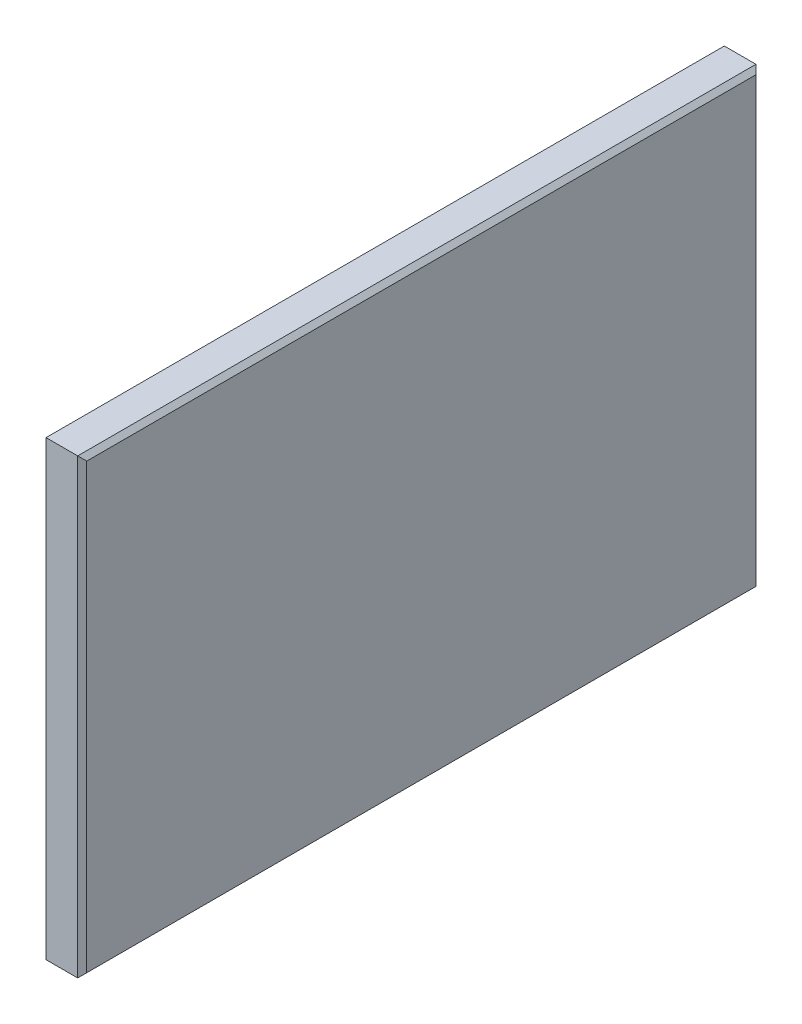
ISO-10303-21;
HEADER;
FILE_DESCRIPTION(('STEP AP214'),'2;1');
FILE_NAME('part.step','',(''),(''),'','','');
FILE_SCHEMA(('AUTOMOTIVE_DESIGN { 1 0 10303 214 1 1 1 1 }'));
ENDSEC;
DATA;
#1=APPLICATION_CONTEXT('core data for automotive mechanical design processes');
#2=APPLICATION_PROTOCOL_DEFINITION('international standard','automotive_design',2000,#1);
#3=PRODUCT_CONTEXT('',#1,'mechanical');
#4=PRODUCT('Part','Part','',(#3));
#5=PRODUCT_RELATED_PRODUCT_CATEGORY('part','',(#4));
#6=PRODUCT_DEFINITION_FORMATION('','',#4);
#7=PRODUCT_DEFINITION_CONTEXT('part definition',#1,'design');
#8=PRODUCT_DEFINITION('design','',#6,#7);
#9=PRODUCT_DEFINITION_SHAPE('','',#8);
#10=(LENGTH_UNIT() NAMED_UNIT(*) SI_UNIT(.MILLI.,.METRE.));
#11=(NAMED_UNIT(*) PLANE_ANGLE_UNIT() SI_UNIT($,.RADIAN.));
#12=(NAMED_UNIT(*) SI_UNIT($,.STERADIAN.) SOLID_ANGLE_UNIT());
#13=UNCERTAINTY_MEASURE_WITH_UNIT(LENGTH_MEASURE(1.E-05),#10,'distance_accuracy_value','');
#14=(GEOMETRIC_REPRESENTATION_CONTEXT(3) GLOBAL_UNCERTAINTY_ASSIGNED_CONTEXT((#13)) GLOBAL_UNIT_ASSIGNED_CONTEXT((#10,
#11,#12)) REPRESENTATION_CONTEXT('',''));
#15=CARTESIAN_POINT('',(0.,0.,0.));
#16=DIRECTION('',(0.,0.,1.));
#17=DIRECTION('',(1.,0.,0.));
#18=AXIS2_PLACEMENT_3D('',#15,#16,#17);
#19=CARTESIAN_POINT('',(4.572,25.4,38.1));
#20=DIRECTION('',(0.,0.,-1.));
#21=DIRECTION('',(-1.,0.,0.));
#22=AXIS2_PLACEMENT_3D('',#19,#20,#21);
#23=PLANE('',#22);
#24=DIRECTION('',(-1.,0.,0.));
#25=VECTOR('',#24,1.);
#26=CARTESIAN_POINT('',(4.572,25.4,38.1));
#27=LINE('',#26,#25);
#28=CARTESIAN_POINT('',(4.06399999999999,25.4,38.1));
#29=VERTEX_POINT('',#28);
#30=CARTESIAN_POINT('',(0.508000000000008,25.4,38.1));
#31=VERTEX_POINT('',#30);
#32=EDGE_CURVE('E142',#29,#31,#27,.T.);
#33=ORIENTED_EDGE('',*,*,#32,.T.);
#34=DIRECTION('',(0.,-1.,0.));
#35=VECTOR('',#34,1.);
#36=CARTESIAN_POINT('',(0.508000000000008,25.4,38.1));
#37=LINE('',#36,#35);
#38=CARTESIAN_POINT('',(0.508000000000008,-25.4,38.1));
#39=VERTEX_POINT('',#38);
#40=EDGE_CURVE('E151',#31,#39,#37,.T.);
#41=ORIENTED_EDGE('',*,*,#40,.T.);
#42=DIRECTION('',(-1.,0.,0.));
#43=VECTOR('',#42,1.);
#44=CARTESIAN_POINT('',(4.572,-25.4,38.1));
#45=LINE('',#44,#43);
#46=CARTESIAN_POINT('',(4.06399999999999,-25.4,38.1));
#47=VERTEX_POINT('',#46);
#48=EDGE_CURVE('E120',#47,#39,#45,.T.);
#49=ORIENTED_EDGE('',*,*,#48,.F.);
#50=DIRECTION('',(0.,1.,0.));
#51=VECTOR('',#50,1.);
#52=CARTESIAN_POINT('',(4.06399999999999,25.4,38.1));
#53=LINE('',#52,#51);
#54=EDGE_CURVE('E153',#47,#29,#53,.T.);
#55=ORIENTED_EDGE('',*,*,#54,.T.);
#56=EDGE_LOOP('',(#33,#41,#49,#55));
#57=FACE_BOUND('',#56,.T.);
#58=ADVANCED_FACE('F33',(#57),#23,.F.);
#59=CARTESIAN_POINT('',(4.572,-25.4,38.1));
#60=DIRECTION('',(0.,1.,0.));
#61=DIRECTION('',(0.,0.,1.));
#62=AXIS2_PLACEMENT_3D('',#59,#60,#61);
#63=PLANE('',#62);
#64=ORIENTED_EDGE('',*,*,#48,.T.);
#65=DIRECTION('',(0.,0.,-1.));
#66=VECTOR('',#65,1.);
#67=CARTESIAN_POINT('',(0.508000000000008,-25.4,38.1));
#68=LINE('',#67,#66);
#69=CARTESIAN_POINT('',(0.508000000000008,-25.4,-38.1));
#70=VERTEX_POINT('',#69);
#71=EDGE_CURVE('E119',#39,#70,#68,.T.);
#72=ORIENTED_EDGE('',*,*,#71,.T.);
#73=DIRECTION('',(-1.,0.,0.));
#74=VECTOR('',#73,1.);
#75=CARTESIAN_POINT('',(4.572,-25.4,-38.1));
#76=LINE('',#75,#74);
#77=CARTESIAN_POINT('',(4.06399999999999,-25.4,-38.1));
#78=VERTEX_POINT('',#77);
#79=EDGE_CURVE('E102',#78,#70,#76,.T.);
#80=ORIENTED_EDGE('',*,*,#79,.F.);
#81=DIRECTION('',(0.,0.,1.));
#82=VECTOR('',#81,1.);
#83=CARTESIAN_POINT('',(4.06399999999999,-25.4,38.1));
#84=LINE('',#83,#82);
#85=EDGE_CURVE('E116',#78,#47,#84,.T.);
#86=ORIENTED_EDGE('',*,*,#85,.T.);
#87=EDGE_LOOP('',(#64,#72,#80,#86));
#88=FACE_BOUND('',#87,.T.);
#89=ADVANCED_FACE('F115',(#88),#63,.F.);
#90=CARTESIAN_POINT('',(4.572,25.4,-38.1));
#91=DIRECTION('',(0.,0.,1.));
#92=DIRECTION('',(0.,-1.,0.));
#93=AXIS2_PLACEMENT_3D('',#90,#91,#92);
#94=PLANE('',#93);
#95=ORIENTED_EDGE('',*,*,#79,.T.);
#96=DIRECTION('',(0.,1.,0.));
#97=VECTOR('',#96,1.);
#98=CARTESIAN_POINT('',(0.508000000000008,25.4,-38.1));
#99=LINE('',#98,#97);
#100=CARTESIAN_POINT('',(0.508000000000008,25.4,-38.1));
#101=VERTEX_POINT('',#100);
#102=EDGE_CURVE('E108',#70,#101,#99,.T.);
#103=ORIENTED_EDGE('',*,*,#102,.T.);
#104=DIRECTION('',(-1.,0.,0.));
#105=VECTOR('',#104,1.);
#106=CARTESIAN_POINT('',(4.572,25.4,-38.1));
#107=LINE('',#106,#105);
#108=CARTESIAN_POINT('',(4.06399999999999,25.4,-38.1));
#109=VERTEX_POINT('',#108);
#110=EDGE_CURVE('E104',#109,#101,#107,.T.);
#111=ORIENTED_EDGE('',*,*,#110,.F.);
#112=DIRECTION('',(0.,-1.,0.));
#113=VECTOR('',#112,1.);
#114=CARTESIAN_POINT('',(4.06399999999999,-25.4,-38.1));
#115=LINE('',#114,#113);
#116=EDGE_CURVE('E99',#109,#78,#115,.T.);
#117=ORIENTED_EDGE('',*,*,#116,.T.);
#118=EDGE_LOOP('',(#95,#103,#111,#117));
#119=FACE_BOUND('',#118,.T.);
#120=ADVANCED_FACE('F101',(#119),#94,.F.);
#121=CARTESIAN_POINT('',(4.572,25.4,38.1));
#122=DIRECTION('',(0.,-1.,0.));
#123=DIRECTION('',(0.,0.,-1.));
#124=AXIS2_PLACEMENT_3D('',#121,#122,#123);
#125=PLANE('',#124);
#126=ORIENTED_EDGE('',*,*,#110,.T.);
#127=DIRECTION('',(0.,0.,1.));
#128=VECTOR('',#127,1.);
#129=CARTESIAN_POINT('',(0.508000000000008,25.4,38.1));
#130=LINE('',#129,#128);
#131=EDGE_CURVE('E155',#101,#31,#130,.T.);
#132=ORIENTED_EDGE('',*,*,#131,.T.);
#133=ORIENTED_EDGE('',*,*,#32,.F.);
#134=DIRECTION('',(0.,0.,-1.));
#135=VECTOR('',#134,1.);
#136=CARTESIAN_POINT('',(4.06399999999999,25.4,-38.1));
#137=LINE('',#136,#135);
#138=EDGE_CURVE('E157',#29,#109,#137,.T.);
#139=ORIENTED_EDGE('',*,*,#138,.T.);
#140=EDGE_LOOP('',(#126,#132,#133,#139));
#141=FACE_BOUND('',#140,.T.);
#142=ADVANCED_FACE('F195',(#141),#125,.F.);
#143=CARTESIAN_POINT('',(4.572,0.,0.));
#144=DIRECTION('',(1.,0.,0.));
#145=DIRECTION('',(0.,0.,-1.));
#146=AXIS2_PLACEMENT_3D('',#143,#144,#145);
#147=PLANE('',#146);
#148=DIRECTION('',(0.,1.,0.));
#149=VECTOR('',#148,1.);
#150=CARTESIAN_POINT('',(4.572,25.4,-37.592));
#151=LINE('',#150,#149);
#152=CARTESIAN_POINT('',(4.572,-24.892,-37.592));
#153=VERTEX_POINT('',#152);
#154=CARTESIAN_POINT('',(4.572,24.892,-37.592));
#155=VERTEX_POINT('',#154);
#156=EDGE_CURVE('E42',#153,#155,#151,.T.);
#157=ORIENTED_EDGE('',*,*,#156,.T.);
#158=DIRECTION('',(0.,0.,1.));
#159=VECTOR('',#158,1.);
#160=CARTESIAN_POINT('',(4.572,24.892,38.1));
#161=LINE('',#160,#159);
#162=CARTESIAN_POINT('',(4.572,24.892,37.592));
#163=VERTEX_POINT('',#162);
#164=EDGE_CURVE('E11',#155,#163,#161,.T.);
#165=ORIENTED_EDGE('',*,*,#164,.T.);
#166=DIRECTION('',(0.,-1.,0.));
#167=VECTOR('',#166,1.);
#168=CARTESIAN_POINT('',(4.572,-25.4,37.592));
#169=LINE('',#168,#167);
#170=CARTESIAN_POINT('',(4.572,-24.892,37.592));
#171=VERTEX_POINT('',#170);
#172=EDGE_CURVE('E149',#163,#171,#169,.T.);
#173=ORIENTED_EDGE('',*,*,#172,.T.);
#174=DIRECTION('',(0.,0.,-1.));
#175=VECTOR('',#174,1.);
#176=CARTESIAN_POINT('',(4.572,-24.892,-38.1));
#177=LINE('',#176,#175);
#178=EDGE_CURVE('E53',#171,#153,#177,.T.);
#179=ORIENTED_EDGE('',*,*,#178,.T.);
#180=EDGE_LOOP('',(#157,#165,#173,#179));
#181=FACE_BOUND('',#180,.T.);
#182=ADVANCED_FACE('F201',(#181),#147,.T.);
#183=CARTESIAN_POINT('',(0.,0.,0.));
#184=DIRECTION('',(1.,0.,0.));
#185=DIRECTION('',(0.,0.,-1.));
#186=AXIS2_PLACEMENT_3D('',#183,#184,#185);
#187=PLANE('',#186);
#188=DIRECTION('',(0.,-1.,0.));
#189=VECTOR('',#188,1.);
#190=CARTESIAN_POINT('',(0.,0.,-37.592));
#191=LINE('',#190,#189);
#192=CARTESIAN_POINT('',(0.,24.892,-37.592));
#193=VERTEX_POINT('',#192);
#194=CARTESIAN_POINT('',(0.,-24.892,-37.592));
#195=VERTEX_POINT('',#194);
#196=EDGE_CURVE('E162',#193,#195,#191,.T.);
#197=ORIENTED_EDGE('',*,*,#196,.T.);
#198=DIRECTION('',(0.,0.,1.));
#199=VECTOR('',#198,1.);
#200=CARTESIAN_POINT('',(0.,-24.892,0.));
#201=LINE('',#200,#199);
#202=CARTESIAN_POINT('',(0.,-24.892,37.592));
#203=VERTEX_POINT('',#202);
#204=EDGE_CURVE('E109',#195,#203,#201,.T.);
#205=ORIENTED_EDGE('',*,*,#204,.T.);
#206=DIRECTION('',(0.,1.,0.));
#207=VECTOR('',#206,1.);
#208=CARTESIAN_POINT('',(0.,0.,37.592));
#209=LINE('',#208,#207);
#210=CARTESIAN_POINT('',(0.,24.892,37.592));
#211=VERTEX_POINT('',#210);
#212=EDGE_CURVE('E166',#203,#211,#209,.T.);
#213=ORIENTED_EDGE('',*,*,#212,.T.);
#214=DIRECTION('',(0.,0.,-1.));
#215=VECTOR('',#214,1.);
#216=CARTESIAN_POINT('',(0.,24.892,0.));
#217=LINE('',#216,#215);
#218=EDGE_CURVE('E164',#211,#193,#217,.T.);
#219=ORIENTED_EDGE('',*,*,#218,.T.);
#220=EDGE_LOOP('',(#197,#205,#213,#219));
#221=FACE_BOUND('',#220,.T.);
#222=ADVANCED_FACE('F203',(#221),#187,.F.);
#223=CARTESIAN_POINT('',(0.508000000000008,25.4,38.1));
#224=DIRECTION('',(0.707106781186547,-0.707106781186547,0.));
#225=DIRECTION('',(0.,0.,1.));
#226=AXIS2_PLACEMENT_3D('',#223,#224,#225);
#227=PLANE('',#226);
#228=DIRECTION('',(-0.57735026918963,-0.57735026918963,0.577350269189618));
#229=VECTOR('',#228,1.);
#230=CARTESIAN_POINT('',(-24.8919999999998,1.76941794549634E-13,-12.7000000000007));
#231=LINE('',#230,#229);
#232=EDGE_CURVE('E143',#193,#101,#231,.F.);
#233=ORIENTED_EDGE('',*,*,#232,.F.);
#234=ORIENTED_EDGE('',*,*,#218,.F.);
#235=DIRECTION('',(-0.577350269189626,-0.577350269189626,-0.577350269189626));
#236=VECTOR('',#235,1.);
#237=CARTESIAN_POINT('',(0.508000000000008,25.4,38.1));
#238=LINE('',#237,#236);
#239=EDGE_CURVE('E139',#31,#211,#238,.T.);
#240=ORIENTED_EDGE('',*,*,#239,.F.);
#241=ORIENTED_EDGE('',*,*,#131,.F.);
#242=EDGE_LOOP('',(#233,#234,#240,#241));
#243=FACE_BOUND('',#242,.T.);
#244=ADVANCED_FACE('F182',(#243),#227,.F.);
#245=CARTESIAN_POINT('',(0.508000000000008,25.4,38.1));
#246=DIRECTION('',(0.707106781186547,0.,-0.707106781186547));
#247=DIRECTION('',(0.,-1.,0.));
#248=AXIS2_PLACEMENT_3D('',#245,#246,#247);
#249=PLANE('',#248);
#250=ORIENTED_EDGE('',*,*,#239,.T.);
#251=ORIENTED_EDGE('',*,*,#212,.F.);
#252=DIRECTION('',(0.577350269189626,-0.577350269189626,0.577350269189626));
#253=VECTOR('',#252,1.);
#254=CARTESIAN_POINT('',(-16.4253333333333,-8.46666666666666,21.1666666666667));
#255=LINE('',#254,#253);
#256=EDGE_CURVE('E130',#39,#203,#255,.F.);
#257=ORIENTED_EDGE('',*,*,#256,.F.);
#258=ORIENTED_EDGE('',*,*,#40,.F.);
#259=EDGE_LOOP('',(#250,#251,#257,#258));
#260=FACE_BOUND('',#259,.T.);
#261=ADVANCED_FACE('F186',(#260),#249,.F.);
#262=CARTESIAN_POINT('',(0.508000000000008,25.4,-38.1));
#263=DIRECTION('',(0.70710678118654,0.,0.707106781186555));
#264=DIRECTION('',(0.,1.,0.));
#265=AXIS2_PLACEMENT_3D('',#262,#263,#264);
#266=PLANE('',#265);
#267=ORIENTED_EDGE('',*,*,#232,.T.);
#268=ORIENTED_EDGE('',*,*,#102,.F.);
#269=DIRECTION('',(-0.57735026918963,0.57735026918963,0.577350269189618));
#270=VECTOR('',#269,1.);
#271=CARTESIAN_POINT('',(-16.4253333333336,-8.46666666666643,-21.1666666666668));
#272=LINE('',#271,#270);
#273=EDGE_CURVE('E129',#195,#70,#272,.F.);
#274=ORIENTED_EDGE('',*,*,#273,.F.);
#275=ORIENTED_EDGE('',*,*,#196,.F.);
#276=EDGE_LOOP('',(#267,#268,#274,#275));
#277=FACE_BOUND('',#276,.T.);
#278=ADVANCED_FACE('F194',(#277),#266,.F.);
#279=CARTESIAN_POINT('',(0.508000000000008,-25.4,38.1));
#280=DIRECTION('',(0.707106781186547,0.707106781186547,0.));
#281=DIRECTION('',(0.,0.,-1.));
#282=AXIS2_PLACEMENT_3D('',#279,#280,#281);
#283=PLANE('',#282);
#284=ORIENTED_EDGE('',*,*,#256,.T.);
#285=ORIENTED_EDGE('',*,*,#204,.F.);
#286=ORIENTED_EDGE('',*,*,#273,.T.);
#287=ORIENTED_EDGE('',*,*,#71,.F.);
#288=EDGE_LOOP('',(#284,#285,#286,#287));
#289=FACE_BOUND('',#288,.T.);
#290=ADVANCED_FACE('F189',(#289),#283,.F.);
#291=CARTESIAN_POINT('',(4.572,-24.892,0.));
#292=DIRECTION('',(0.707106781186547,-0.707106781186547,0.));
#293=DIRECTION('',(0.,0.,1.));
#294=AXIS2_PLACEMENT_3D('',#291,#292,#293);
#295=PLANE('',#294);
#296=DIRECTION('',(0.577350269189626,0.577350269189626,-0.577350269189626));
#297=VECTOR('',#296,1.);
#298=CARTESIAN_POINT('',(12.8693333333333,-16.5946666666667,29.2946666666667));
#299=LINE('',#298,#297);
#300=EDGE_CURVE('E125',#47,#171,#299,.T.);
#301=ORIENTED_EDGE('',*,*,#300,.F.);
#302=ORIENTED_EDGE('',*,*,#85,.F.);
#303=DIRECTION('',(0.57735026918963,0.57735026918963,0.577350269189618));
#304=VECTOR('',#303,1.);
#305=CARTESIAN_POINT('',(17.1026666666666,-12.3613333333334,-25.0613333333337));
#306=LINE('',#305,#304);
#307=EDGE_CURVE('E37',#153,#78,#306,.F.);
#308=ORIENTED_EDGE('',*,*,#307,.F.);
#309=ORIENTED_EDGE('',*,*,#178,.F.);
#310=EDGE_LOOP('',(#301,#302,#308,#309));
#311=FACE_BOUND('',#310,.T.);
#312=ADVANCED_FACE('F35',(#311),#295,.T.);
#313=CARTESIAN_POINT('',(4.572,0.,-37.592));
#314=DIRECTION('',(0.70710678118654,0.,-0.707106781186555));
#315=DIRECTION('',(0.,-1.,0.));
#316=AXIS2_PLACEMENT_3D('',#313,#314,#315);
#317=PLANE('',#316);
#318=ORIENTED_EDGE('',*,*,#307,.T.);
#319=ORIENTED_EDGE('',*,*,#116,.F.);
#320=DIRECTION('',(0.57735026918963,-0.57735026918963,0.577350269189618));
#321=VECTOR('',#320,1.);
#322=CARTESIAN_POINT('',(12.8693333333334,16.5946666666666,-29.2946666666667));
#323=LINE('',#322,#321);
#324=EDGE_CURVE('E132',#155,#109,#323,.F.);
#325=ORIENTED_EDGE('',*,*,#324,.F.);
#326=ORIENTED_EDGE('',*,*,#156,.F.);
#327=EDGE_LOOP('',(#318,#319,#325,#326));
#328=FACE_BOUND('',#327,.T.);
#329=ADVANCED_FACE('F128',(#328),#317,.T.);
#330=CARTESIAN_POINT('',(4.572,0.,37.592));
#331=DIRECTION('',(0.707106781186547,0.,0.707106781186547));
#332=DIRECTION('',(0.,1.,0.));
#333=AXIS2_PLACEMENT_3D('',#330,#331,#332);
#334=PLANE('',#333);
#335=ORIENTED_EDGE('',*,*,#300,.T.);
#336=ORIENTED_EDGE('',*,*,#172,.F.);
#337=DIRECTION('',(-0.577350269189626,0.577350269189626,0.577350269189626));
#338=VECTOR('',#337,1.);
#339=CARTESIAN_POINT('',(12.8693333333333,16.5946666666667,29.2946666666667));
#340=LINE('',#339,#338);
#341=EDGE_CURVE('E135',#29,#163,#340,.F.);
#342=ORIENTED_EDGE('',*,*,#341,.F.);
#343=ORIENTED_EDGE('',*,*,#54,.F.);
#344=EDGE_LOOP('',(#335,#336,#342,#343));
#345=FACE_BOUND('',#344,.T.);
#346=ADVANCED_FACE('F200',(#345),#334,.T.);
#347=CARTESIAN_POINT('',(4.572,24.892,0.));
#348=DIRECTION('',(0.707106781186547,0.707106781186547,0.));
#349=DIRECTION('',(0.,0.,-1.));
#350=AXIS2_PLACEMENT_3D('',#347,#348,#349);
#351=PLANE('',#350);
#352=ORIENTED_EDGE('',*,*,#324,.T.);
#353=ORIENTED_EDGE('',*,*,#138,.F.);
#354=ORIENTED_EDGE('',*,*,#341,.T.);
#355=ORIENTED_EDGE('',*,*,#164,.F.);
#356=EDGE_LOOP('',(#352,#353,#354,#355));
#357=FACE_BOUND('',#356,.T.);
#358=ADVANCED_FACE('F198',(#357),#351,.T.);
#359=CLOSED_SHELL('',(#58,#89,#120,#142,#182,#222,#244,#261,#278,#290,#312,#329,#346,#358));
#360=MANIFOLD_SOLID_BREP('B2',#359);
#361=ADVANCED_BREP_SHAPE_REPRESENTATION('',(#18,#360),#14);
#362=SHAPE_DEFINITION_REPRESENTATION(#9,#361);
ENDSEC;
END-ISO-10303-21;
